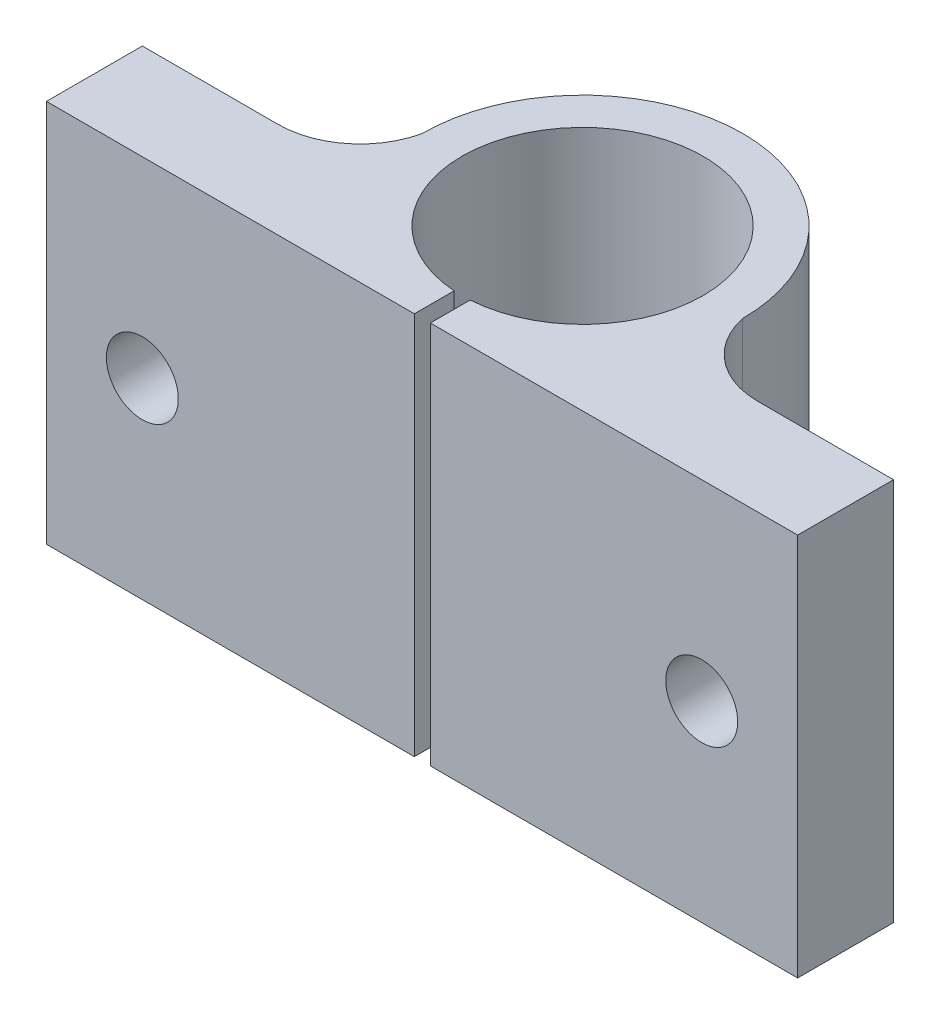
ISO-10303-21;
HEADER;
FILE_DESCRIPTION(('STEP AP214'),'2;1');
FILE_NAME('part.step','',(''),(''),'','','');
FILE_SCHEMA(('AUTOMOTIVE_DESIGN { 1 0 10303 214 1 1 1 1 }'));
ENDSEC;
DATA;
#1=APPLICATION_CONTEXT('core data for automotive mechanical design processes');
#2=APPLICATION_PROTOCOL_DEFINITION('international standard','automotive_design',2000,#1);
#3=PRODUCT_CONTEXT('',#1,'mechanical');
#4=PRODUCT('Part','Part','',(#3));
#5=PRODUCT_RELATED_PRODUCT_CATEGORY('part','',(#4));
#6=PRODUCT_DEFINITION_FORMATION('','',#4);
#7=PRODUCT_DEFINITION_CONTEXT('part definition',#1,'design');
#8=PRODUCT_DEFINITION('design','',#6,#7);
#9=PRODUCT_DEFINITION_SHAPE('','',#8);
#10=(LENGTH_UNIT() NAMED_UNIT(*) SI_UNIT(.MILLI.,.METRE.));
#11=(NAMED_UNIT(*) PLANE_ANGLE_UNIT() SI_UNIT($,.RADIAN.));
#12=(NAMED_UNIT(*) SI_UNIT($,.STERADIAN.) SOLID_ANGLE_UNIT());
#13=UNCERTAINTY_MEASURE_WITH_UNIT(LENGTH_MEASURE(1.E-05),#10,'distance_accuracy_value','');
#14=(GEOMETRIC_REPRESENTATION_CONTEXT(3) GLOBAL_UNCERTAINTY_ASSIGNED_CONTEXT((#13)) GLOBAL_UNIT_ASSIGNED_CONTEXT((#10,
#11,#12)) REPRESENTATION_CONTEXT('',''));
#15=CARTESIAN_POINT('',(0.,0.,0.));
#16=DIRECTION('',(0.,0.,1.));
#17=DIRECTION('',(1.,0.,0.));
#18=AXIS2_PLACEMENT_3D('',#15,#16,#17);
#19=CARTESIAN_POINT('',(0.,0.,0.));
#20=DIRECTION('',(0.,0.,1.));
#21=DIRECTION('',(1.,0.,0.));
#22=AXIS2_PLACEMENT_3D('',#19,#20,#21);
#23=PLANE('',#22);
#24=CARTESIAN_POINT('',(41.,12.,0.));
#25=DIRECTION('',(0.,0.,-1.));
#26=DIRECTION('',(-1.,0.,0.));
#27=AXIS2_PLACEMENT_3D('',#24,#25,#26);
#28=CIRCLE('',#27,2.25);
#29=CARTESIAN_POINT('',(38.75,12.,0.));
#30=VERTEX_POINT('',#29);
#31=EDGE_CURVE('E222',#30,#30,#28,.T.);
#32=ORIENTED_EDGE('',*,*,#31,.T.);
#33=EDGE_LOOP('',(#32));
#34=FACE_BOUND('',#33,.T.);
#35=DIRECTION('',(0.,-1.,0.));
#36=VECTOR('',#35,1.);
#37=CARTESIAN_POINT('',(24.0186333106229,24.,0.));
#38=LINE('',#37,#36);
#39=CARTESIAN_POINT('',(24.0186333106229,24.,0.));
#40=VERTEX_POINT('',#39);
#41=CARTESIAN_POINT('',(24.0186333106229,0.,0.));
#42=VERTEX_POINT('',#41);
#43=EDGE_CURVE('E234',#40,#42,#38,.T.);
#44=ORIENTED_EDGE('',*,*,#43,.T.);
#45=DIRECTION('',(1.,0.,0.));
#46=VECTOR('',#45,1.);
#47=CARTESIAN_POINT('',(0.,0.,0.));
#48=LINE('',#47,#46);
#49=CARTESIAN_POINT('',(47.,0.,0.));
#50=VERTEX_POINT('',#49);
#51=EDGE_CURVE('E247',#42,#50,#48,.T.);
#52=ORIENTED_EDGE('',*,*,#51,.T.);
#53=DIRECTION('',(0.,1.,0.));
#54=VECTOR('',#53,1.);
#55=CARTESIAN_POINT('',(47.,0.,0.));
#56=LINE('',#55,#54);
#57=CARTESIAN_POINT('',(47.,24.,0.));
#58=VERTEX_POINT('',#57);
#59=EDGE_CURVE('E173',#50,#58,#56,.T.);
#60=ORIENTED_EDGE('',*,*,#59,.T.);
#61=DIRECTION('',(1.,0.,0.));
#62=VECTOR('',#61,1.);
#63=CARTESIAN_POINT('',(0.,24.,0.));
#64=LINE('',#63,#62);
#65=EDGE_CURVE('E147',#40,#58,#64,.T.);
#66=ORIENTED_EDGE('',*,*,#65,.F.);
#67=EDGE_LOOP('',(#44,#52,#60,#66));
#68=FACE_BOUND('',#67,.T.);
#69=ADVANCED_FACE('F32',(#34,#68),#23,.T.);
#70=CARTESIAN_POINT('',(0.,0.,-6.));
#71=DIRECTION('',(-1.,0.,0.));
#72=DIRECTION('',(0.,0.,1.));
#73=AXIS2_PLACEMENT_3D('',#70,#71,#72);
#74=PLANE('',#73);
#75=DIRECTION('',(0.,0.,1.));
#76=VECTOR('',#75,1.);
#77=CARTESIAN_POINT('',(0.,24.,-6.));
#78=LINE('',#77,#76);
#79=CARTESIAN_POINT('',(0.,24.,-6.));
#80=VERTEX_POINT('',#79);
#81=CARTESIAN_POINT('',(0.,24.,0.));
#82=VERTEX_POINT('',#81);
#83=EDGE_CURVE('E144',#80,#82,#78,.T.);
#84=ORIENTED_EDGE('',*,*,#83,.F.);
#85=DIRECTION('',(0.,1.,0.));
#86=VECTOR('',#85,1.);
#87=CARTESIAN_POINT('',(0.,0.,-6.));
#88=LINE('',#87,#86);
#89=CARTESIAN_POINT('',(0.,0.,-6.));
#90=VERTEX_POINT('',#89);
#91=EDGE_CURVE('E11',#90,#80,#88,.T.);
#92=ORIENTED_EDGE('',*,*,#91,.F.);
#93=DIRECTION('',(0.,0.,1.));
#94=VECTOR('',#93,1.);
#95=CARTESIAN_POINT('',(0.,0.,-6.));
#96=LINE('',#95,#94);
#97=CARTESIAN_POINT('',(0.,0.,0.));
#98=VERTEX_POINT('',#97);
#99=EDGE_CURVE('E166',#90,#98,#96,.T.);
#100=ORIENTED_EDGE('',*,*,#99,.T.);
#101=DIRECTION('',(0.,1.,0.));
#102=VECTOR('',#101,1.);
#103=CARTESIAN_POINT('',(0.,0.,0.));
#104=LINE('',#103,#102);
#105=EDGE_CURVE('E36',#98,#82,#104,.T.);
#106=ORIENTED_EDGE('',*,*,#105,.T.);
#107=EDGE_LOOP('',(#84,#92,#100,#106));
#108=FACE_BOUND('',#107,.T.);
#109=ADVANCED_FACE('F34',(#108),#74,.T.);
#110=CARTESIAN_POINT('',(8.50000000000001,0.,-6.));
#111=DIRECTION('',(0.,0.,-1.));
#112=DIRECTION('',(-1.,0.,0.));
#113=AXIS2_PLACEMENT_3D('',#110,#111,#112);
#114=PLANE('',#113);
#115=CARTESIAN_POINT('',(5.99999999999998,12.,-6.00000000000001));
#116=DIRECTION('',(0.,0.,-1.));
#117=DIRECTION('',(-1.,0.,0.));
#118=AXIS2_PLACEMENT_3D('',#115,#116,#117);
#119=CIRCLE('',#118,2.25);
#120=CARTESIAN_POINT('',(3.74999999999998,12.,-6.00000000000001));
#121=VERTEX_POINT('',#120);
#122=EDGE_CURVE('E217',#121,#121,#119,.T.);
#123=ORIENTED_EDGE('',*,*,#122,.F.);
#124=EDGE_LOOP('',(#123));
#125=FACE_BOUND('',#124,.T.);
#126=DIRECTION('',(-1.,0.,0.));
#127=VECTOR('',#126,1.);
#128=CARTESIAN_POINT('',(8.50000000000001,24.,-6.));
#129=LINE('',#128,#127);
#130=CARTESIAN_POINT('',(8.50000000000001,24.,-6.00000000000002));
#131=VERTEX_POINT('',#130);
#132=EDGE_CURVE('E164',#131,#80,#129,.T.);
#133=ORIENTED_EDGE('',*,*,#132,.F.);
#134=DIRECTION('',(0.,1.,0.));
#135=VECTOR('',#134,1.);
#136=CARTESIAN_POINT('',(8.50000000000001,0.,-6.00000000000002));
#137=LINE('',#136,#135);
#138=CARTESIAN_POINT('',(8.50000000000001,0.,-6.00000000000002));
#139=VERTEX_POINT('',#138);
#140=EDGE_CURVE('E41',#139,#131,#137,.T.);
#141=ORIENTED_EDGE('',*,*,#140,.F.);
#142=DIRECTION('',(-1.,0.,0.));
#143=VECTOR('',#142,1.);
#144=CARTESIAN_POINT('',(8.50000000000001,0.,-6.));
#145=LINE('',#144,#143);
#146=EDGE_CURVE('E134',#139,#90,#145,.T.);
#147=ORIENTED_EDGE('',*,*,#146,.T.);
#148=ORIENTED_EDGE('',*,*,#91,.T.);
#149=EDGE_LOOP('',(#133,#141,#147,#148));
#150=FACE_BOUND('',#149,.T.);
#151=ADVANCED_FACE('F186',(#125,#150),#114,.T.);
#152=CARTESIAN_POINT('',(8.50000000000001,0.,-11.1210427356607));
#153=DIRECTION('',(0.,1.,0.));
#154=DIRECTION('',(0.,0.,1.));
#155=AXIS2_PLACEMENT_3D('',#152,#153,#154);
#156=CYLINDRICAL_SURFACE('',#155,5.12104273566066);
#157=CARTESIAN_POINT('',(8.50000000000001,24.,-11.1210427356607));
#158=DIRECTION('',(0.,-1.,0.));
#159=DIRECTION('',(0.,0.,-1.));
#160=AXIS2_PLACEMENT_3D('',#157,#158,#159);
#161=CIRCLE('',#160,5.12104273566066);
#162=CARTESIAN_POINT('',(13.4959473897421,24.,-9.99605901160399));
#163=VERTEX_POINT('',#162);
#164=EDGE_CURVE('E120',#163,#131,#161,.T.);
#165=ORIENTED_EDGE('',*,*,#164,.F.);
#166=DIRECTION('',(0.,1.,0.));
#167=VECTOR('',#166,1.);
#168=CARTESIAN_POINT('',(13.4959473897421,0.,-9.99605901160399));
#169=LINE('',#168,#167);
#170=CARTESIAN_POINT('',(13.4959473897421,0.,-9.99605901160399));
#171=VERTEX_POINT('',#170);
#172=EDGE_CURVE('E114',#171,#163,#169,.T.);
#173=ORIENTED_EDGE('',*,*,#172,.F.);
#174=CARTESIAN_POINT('',(8.50000000000001,0.,-11.1210427356607));
#175=DIRECTION('',(0.,-1.,0.));
#176=DIRECTION('',(0.,0.,-1.));
#177=AXIS2_PLACEMENT_3D('',#174,#175,#176);
#178=CIRCLE('',#177,5.12104273566066);
#179=EDGE_CURVE('E117',#171,#139,#178,.T.);
#180=ORIENTED_EDGE('',*,*,#179,.T.);
#181=ORIENTED_EDGE('',*,*,#140,.T.);
#182=EDGE_LOOP('',(#165,#173,#180,#181));
#183=FACE_BOUND('',#182,.T.);
#184=ADVANCED_FACE('F116',(#183),#156,.F.);
#185=CARTESIAN_POINT('',(23.5186333106229,0.,-10.0227213844719));
#186=DIRECTION('',(0.,1.,0.));
#187=DIRECTION('',(0.,0.,1.));
#188=AXIS2_PLACEMENT_3D('',#185,#186,#187);
#189=CYLINDRICAL_SURFACE('',#188,10.0227213844719);
#190=CARTESIAN_POINT('',(23.5186333106229,24.,-10.0227213844719));
#191=DIRECTION('',(0.,1.,0.));
#192=DIRECTION('',(0.,0.,1.));
#193=AXIS2_PLACEMENT_3D('',#190,#191,#192);
#194=CIRCLE('',#193,10.0227213844719);
#195=CARTESIAN_POINT('',(33.5413546555968,24.,-10.021831577252));
#196=VERTEX_POINT('',#195);
#197=EDGE_CURVE('E161',#196,#163,#194,.T.);
#198=ORIENTED_EDGE('',*,*,#197,.F.);
#199=DIRECTION('',(0.,1.,0.));
#200=VECTOR('',#199,1.);
#201=CARTESIAN_POINT('',(33.5413546555968,0.,-10.021831577252));
#202=LINE('',#201,#200);
#203=CARTESIAN_POINT('',(33.5413546555968,0.,-10.021831577252));
#204=VERTEX_POINT('',#203);
#205=EDGE_CURVE('E125',#204,#196,#202,.T.);
#206=ORIENTED_EDGE('',*,*,#205,.F.);
#207=CARTESIAN_POINT('',(23.5186333106229,0.,-10.0227213844719));
#208=DIRECTION('',(0.,1.,0.));
#209=DIRECTION('',(0.,0.,1.));
#210=AXIS2_PLACEMENT_3D('',#207,#208,#209);
#211=CIRCLE('',#210,10.0227213844719);
#212=EDGE_CURVE('E132',#204,#171,#211,.T.);
#213=ORIENTED_EDGE('',*,*,#212,.T.);
#214=ORIENTED_EDGE('',*,*,#172,.T.);
#215=EDGE_LOOP('',(#198,#206,#213,#214));
#216=FACE_BOUND('',#215,.T.);
#217=ADVANCED_FACE('F136',(#216),#189,.T.);
#218=CARTESIAN_POINT('',(38.5000000000001,0.,-11.0677523541657));
#219=DIRECTION('',(0.,1.,0.));
#220=DIRECTION('',(0.,0.,1.));
#221=AXIS2_PLACEMENT_3D('',#218,#219,#220);
#222=CYLINDRICAL_SURFACE('',#221,5.06775235416579);
#223=CARTESIAN_POINT('',(38.5000000000001,24.,-11.0677523541657));
#224=DIRECTION('',(0.,-1.,0.));
#225=DIRECTION('',(0.,0.,-1.));
#226=AXIS2_PLACEMENT_3D('',#223,#224,#225);
#227=CIRCLE('',#226,5.06775235416579);
#228=CARTESIAN_POINT('',(38.5,24.,-6.00000000000001));
#229=VERTEX_POINT('',#228);
#230=EDGE_CURVE('E158',#229,#196,#227,.T.);
#231=ORIENTED_EDGE('',*,*,#230,.F.);
#232=DIRECTION('',(0.,1.,0.));
#233=VECTOR('',#232,1.);
#234=CARTESIAN_POINT('',(38.5,0.,-6.00000000000001));
#235=LINE('',#234,#233);
#236=CARTESIAN_POINT('',(38.5,0.,-6.00000000000001));
#237=VERTEX_POINT('',#236);
#238=EDGE_CURVE('E170',#237,#229,#235,.T.);
#239=ORIENTED_EDGE('',*,*,#238,.F.);
#240=CARTESIAN_POINT('',(38.5000000000001,0.,-11.0677523541657));
#241=DIRECTION('',(0.,-1.,0.));
#242=DIRECTION('',(0.,0.,-1.));
#243=AXIS2_PLACEMENT_3D('',#240,#241,#242);
#244=CIRCLE('',#243,5.06775235416579);
#245=EDGE_CURVE('E137',#237,#204,#244,.T.);
#246=ORIENTED_EDGE('',*,*,#245,.T.);
#247=ORIENTED_EDGE('',*,*,#205,.T.);
#248=EDGE_LOOP('',(#231,#239,#246,#247));
#249=FACE_BOUND('',#248,.T.);
#250=ADVANCED_FACE('F305',(#249),#222,.F.);
#251=CARTESIAN_POINT('',(47.,0.,-6.));
#252=DIRECTION('',(0.,0.,-1.));
#253=DIRECTION('',(-1.,0.,0.));
#254=AXIS2_PLACEMENT_3D('',#251,#252,#253);
#255=PLANE('',#254);
#256=CARTESIAN_POINT('',(41.,12.,-6.00000000000001));
#257=DIRECTION('',(0.,0.,-1.));
#258=DIRECTION('',(-1.,0.,0.));
#259=AXIS2_PLACEMENT_3D('',#256,#257,#258);
#260=CIRCLE('',#259,2.25);
#261=CARTESIAN_POINT('',(38.75,12.,-6.00000000000001));
#262=VERTEX_POINT('',#261);
#263=EDGE_CURVE('E301',#262,#262,#260,.T.);
#264=ORIENTED_EDGE('',*,*,#263,.F.);
#265=EDGE_LOOP('',(#264));
#266=FACE_BOUND('',#265,.T.);
#267=DIRECTION('',(-1.,0.,0.));
#268=VECTOR('',#267,1.);
#269=CARTESIAN_POINT('',(47.,24.,-6.));
#270=LINE('',#269,#268);
#271=CARTESIAN_POINT('',(47.,24.,-6.));
#272=VERTEX_POINT('',#271);
#273=EDGE_CURVE('E155',#272,#229,#270,.T.);
#274=ORIENTED_EDGE('',*,*,#273,.F.);
#275=DIRECTION('',(0.,1.,0.));
#276=VECTOR('',#275,1.);
#277=CARTESIAN_POINT('',(47.,0.,-6.));
#278=LINE('',#277,#276);
#279=CARTESIAN_POINT('',(47.,0.,-6.));
#280=VERTEX_POINT('',#279);
#281=EDGE_CURVE('E172',#280,#272,#278,.T.);
#282=ORIENTED_EDGE('',*,*,#281,.F.);
#283=DIRECTION('',(-1.,0.,0.));
#284=VECTOR('',#283,1.);
#285=CARTESIAN_POINT('',(47.,0.,-6.));
#286=LINE('',#285,#284);
#287=EDGE_CURVE('E139',#280,#237,#286,.T.);
#288=ORIENTED_EDGE('',*,*,#287,.T.);
#289=ORIENTED_EDGE('',*,*,#238,.T.);
#290=EDGE_LOOP('',(#274,#282,#288,#289));
#291=FACE_BOUND('',#290,.T.);
#292=ADVANCED_FACE('F211',(#266,#291),#255,.T.);
#293=CARTESIAN_POINT('',(47.,0.,0.));
#294=DIRECTION('',(1.,0.,0.));
#295=DIRECTION('',(0.,0.,-1.));
#296=AXIS2_PLACEMENT_3D('',#293,#294,#295);
#297=PLANE('',#296);
#298=DIRECTION('',(0.,0.,-1.));
#299=VECTOR('',#298,1.);
#300=CARTESIAN_POINT('',(47.,24.,0.));
#301=LINE('',#300,#299);
#302=EDGE_CURVE('E152',#58,#272,#301,.T.);
#303=ORIENTED_EDGE('',*,*,#302,.F.);
#304=ORIENTED_EDGE('',*,*,#59,.F.);
#305=DIRECTION('',(0.,0.,-1.));
#306=VECTOR('',#305,1.);
#307=CARTESIAN_POINT('',(47.,0.,0.));
#308=LINE('',#307,#306);
#309=EDGE_CURVE('E250',#50,#280,#308,.T.);
#310=ORIENTED_EDGE('',*,*,#309,.T.);
#311=ORIENTED_EDGE('',*,*,#281,.T.);
#312=EDGE_LOOP('',(#303,#304,#310,#311));
#313=FACE_BOUND('',#312,.T.);
#314=ADVANCED_FACE('F204',(#313),#297,.T.);
#315=CARTESIAN_POINT('',(5.99999999999998,12.,0.));
#316=DIRECTION('',(0.,0.,-1.));
#317=DIRECTION('',(-1.,0.,0.));
#318=AXIS2_PLACEMENT_3D('',#315,#316,#317);
#319=CIRCLE('',#318,2.25);
#320=CARTESIAN_POINT('',(3.74999999999998,12.,0.));
#321=VERTEX_POINT('',#320);
#322=EDGE_CURVE('E215',#321,#321,#319,.T.);
#323=ORIENTED_EDGE('',*,*,#322,.T.);
#324=EDGE_LOOP('',(#323));
#325=FACE_BOUND('',#324,.T.);
#326=DIRECTION('',(0.,-1.,0.));
#327=VECTOR('',#326,1.);
#328=CARTESIAN_POINT('',(23.0186333106229,24.,0.));
#329=LINE('',#328,#327);
#330=CARTESIAN_POINT('',(23.0186333106229,24.,0.));
#331=VERTEX_POINT('',#330);
#332=CARTESIAN_POINT('',(23.0186333106229,0.,0.));
#333=VERTEX_POINT('',#332);
#334=EDGE_CURVE('E182',#331,#333,#329,.T.);
#335=ORIENTED_EDGE('',*,*,#334,.F.);
#336=EDGE_CURVE('E149',#82,#331,#64,.T.);
#337=ORIENTED_EDGE('',*,*,#336,.F.);
#338=ORIENTED_EDGE('',*,*,#105,.F.);
#339=EDGE_CURVE('E248',#98,#333,#48,.T.);
#340=ORIENTED_EDGE('',*,*,#339,.T.);
#341=EDGE_LOOP('',(#335,#337,#338,#340));
#342=FACE_BOUND('',#341,.T.);
#343=ADVANCED_FACE('F180',(#325,#342),#23,.T.);
#344=CARTESIAN_POINT('',(38.5000000000001,0.,-11.0677523541657));
#345=DIRECTION('',(0.,-1.,0.));
#346=DIRECTION('',(0.,0.,-1.));
#347=AXIS2_PLACEMENT_3D('',#344,#345,#346);
#348=PLANE('',#347);
#349=CARTESIAN_POINT('',(23.5186333106229,0.,-10.022721384472));
#350=DIRECTION('',(0.,1.,0.));
#351=DIRECTION('',(0.,0.,1.));
#352=AXIS2_PLACEMENT_3D('',#349,#350,#351);
#353=CIRCLE('',#352,7.55000000000005);
#354=CARTESIAN_POINT('',(24.0186333106229,0.,-2.48929586881175));
#355=VERTEX_POINT('',#354);
#356=CARTESIAN_POINT('',(23.0186333106229,0.,-2.48929586881175));
#357=VERTEX_POINT('',#356);
#358=EDGE_CURVE('E219',#355,#357,#353,.T.);
#359=ORIENTED_EDGE('',*,*,#358,.T.);
#360=DIRECTION('',(0.,0.,-1.));
#361=VECTOR('',#360,1.);
#362=CARTESIAN_POINT('',(23.0186333106229,0.,0.));
#363=LINE('',#362,#361);
#364=EDGE_CURVE('E232',#333,#357,#363,.T.);
#365=ORIENTED_EDGE('',*,*,#364,.F.);
#366=ORIENTED_EDGE('',*,*,#339,.F.);
#367=ORIENTED_EDGE('',*,*,#99,.F.);
#368=ORIENTED_EDGE('',*,*,#146,.F.);
#369=ORIENTED_EDGE('',*,*,#179,.F.);
#370=ORIENTED_EDGE('',*,*,#212,.F.);
#371=ORIENTED_EDGE('',*,*,#245,.F.);
#372=ORIENTED_EDGE('',*,*,#287,.F.);
#373=ORIENTED_EDGE('',*,*,#309,.F.);
#374=ORIENTED_EDGE('',*,*,#51,.F.);
#375=DIRECTION('',(0.,0.,1.));
#376=VECTOR('',#375,1.);
#377=CARTESIAN_POINT('',(24.0186333106229,0.,-2.48929586881175));
#378=LINE('',#377,#376);
#379=EDGE_CURVE('E227',#355,#42,#378,.T.);
#380=ORIENTED_EDGE('',*,*,#379,.F.);
#381=EDGE_LOOP('',(#359,#365,#366,#367,#368,#369,#370,#371,#372,#373,#374,#380));
#382=FACE_BOUND('',#381,.T.);
#383=ADVANCED_FACE('F130',(#382),#348,.T.);
#384=CARTESIAN_POINT('',(38.5000000000001,24.,-11.0677523541657));
#385=DIRECTION('',(0.,-1.,0.));
#386=DIRECTION('',(0.,0.,-1.));
#387=AXIS2_PLACEMENT_3D('',#384,#385,#386);
#388=PLANE('',#387);
#389=DIRECTION('',(0.,0.,-1.));
#390=VECTOR('',#389,1.);
#391=CARTESIAN_POINT('',(23.0186333106229,24.,0.));
#392=LINE('',#391,#390);
#393=CARTESIAN_POINT('',(23.0186333106229,24.,-2.48929586881175));
#394=VERTEX_POINT('',#393);
#395=EDGE_CURVE('E231',#331,#394,#392,.T.);
#396=ORIENTED_EDGE('',*,*,#395,.T.);
#397=CARTESIAN_POINT('',(23.5186333106229,24.,-10.022721384472));
#398=DIRECTION('',(0.,1.,0.));
#399=DIRECTION('',(0.,0.,1.));
#400=AXIS2_PLACEMENT_3D('',#397,#398,#399);
#401=CIRCLE('',#400,7.55000000000005);
#402=CARTESIAN_POINT('',(24.0186333106229,24.,-2.48929586881175));
#403=VERTEX_POINT('',#402);
#404=EDGE_CURVE('E49',#403,#394,#401,.T.);
#405=ORIENTED_EDGE('',*,*,#404,.F.);
#406=DIRECTION('',(0.,0.,1.));
#407=VECTOR('',#406,1.);
#408=CARTESIAN_POINT('',(24.0186333106229,24.,-2.48929586881175));
#409=LINE('',#408,#407);
#410=EDGE_CURVE('E228',#403,#40,#409,.T.);
#411=ORIENTED_EDGE('',*,*,#410,.T.);
#412=ORIENTED_EDGE('',*,*,#65,.T.);
#413=ORIENTED_EDGE('',*,*,#302,.T.);
#414=ORIENTED_EDGE('',*,*,#273,.T.);
#415=ORIENTED_EDGE('',*,*,#230,.T.);
#416=ORIENTED_EDGE('',*,*,#197,.T.);
#417=ORIENTED_EDGE('',*,*,#164,.T.);
#418=ORIENTED_EDGE('',*,*,#132,.T.);
#419=ORIENTED_EDGE('',*,*,#83,.T.);
#420=ORIENTED_EDGE('',*,*,#336,.T.);
#421=EDGE_LOOP('',(#396,#405,#411,#412,#413,#414,#415,#416,#417,#418,#419,#420));
#422=FACE_BOUND('',#421,.T.);
#423=ADVANCED_FACE('F185',(#422),#388,.F.);
#424=CARTESIAN_POINT('',(24.0186333106229,24.,-2.48929586881175));
#425=DIRECTION('',(1.,0.,0.));
#426=DIRECTION('',(0.,0.,-1.));
#427=AXIS2_PLACEMENT_3D('',#424,#425,#426);
#428=PLANE('',#427);
#429=ORIENTED_EDGE('',*,*,#379,.T.);
#430=ORIENTED_EDGE('',*,*,#43,.F.);
#431=ORIENTED_EDGE('',*,*,#410,.F.);
#432=DIRECTION('',(0.,-1.,0.));
#433=VECTOR('',#432,1.);
#434=CARTESIAN_POINT('',(24.0186333106229,24.,-2.48929586881175));
#435=LINE('',#434,#433);
#436=EDGE_CURVE('E148',#403,#355,#435,.T.);
#437=ORIENTED_EDGE('',*,*,#436,.T.);
#438=EDGE_LOOP('',(#429,#430,#431,#437));
#439=FACE_BOUND('',#438,.T.);
#440=ADVANCED_FACE('F276',(#439),#428,.F.);
#441=CARTESIAN_POINT('',(23.0186333106229,24.,0.));
#442=DIRECTION('',(-1.,0.,0.));
#443=DIRECTION('',(0.,0.,1.));
#444=AXIS2_PLACEMENT_3D('',#441,#442,#443);
#445=PLANE('',#444);
#446=ORIENTED_EDGE('',*,*,#364,.T.);
#447=DIRECTION('',(0.,-1.,0.));
#448=VECTOR('',#447,1.);
#449=CARTESIAN_POINT('',(23.0186333106229,24.,-2.48929586881175));
#450=LINE('',#449,#448);
#451=EDGE_CURVE('E241',#394,#357,#450,.T.);
#452=ORIENTED_EDGE('',*,*,#451,.F.);
#453=ORIENTED_EDGE('',*,*,#395,.F.);
#454=ORIENTED_EDGE('',*,*,#334,.T.);
#455=EDGE_LOOP('',(#446,#452,#453,#454));
#456=FACE_BOUND('',#455,.T.);
#457=ADVANCED_FACE('F278',(#456),#445,.F.);
#458=CARTESIAN_POINT('',(23.5186333106229,0.,-10.022721384472));
#459=DIRECTION('',(0.,1.,0.));
#460=DIRECTION('',(0.,0.,1.));
#461=AXIS2_PLACEMENT_3D('',#458,#459,#460);
#462=CYLINDRICAL_SURFACE('',#461,7.55000000000005);
#463=ORIENTED_EDGE('',*,*,#404,.T.);
#464=ORIENTED_EDGE('',*,*,#451,.T.);
#465=ORIENTED_EDGE('',*,*,#358,.F.);
#466=ORIENTED_EDGE('',*,*,#436,.F.);
#467=EDGE_LOOP('',(#463,#464,#465,#466));
#468=FACE_BOUND('',#467,.T.);
#469=ADVANCED_FACE('F275',(#468),#462,.F.);
#470=CARTESIAN_POINT('',(5.99999999999998,12.,-6.00000000000001));
#471=DIRECTION('',(0.,0.,-1.));
#472=DIRECTION('',(-1.,0.,0.));
#473=AXIS2_PLACEMENT_3D('',#470,#471,#472);
#474=CYLINDRICAL_SURFACE('',#473,2.25);
#475=ORIENTED_EDGE('',*,*,#322,.F.);
#476=EDGE_LOOP('',(#475));
#477=FACE_BOUND('',#476,.T.);
#478=ORIENTED_EDGE('',*,*,#122,.T.);
#479=EDGE_LOOP('',(#478));
#480=FACE_BOUND('',#479,.T.);
#481=ADVANCED_FACE('F289',(#477,#480),#474,.F.);
#482=CARTESIAN_POINT('',(41.,12.,-6.00000000000001));
#483=DIRECTION('',(0.,0.,-1.));
#484=DIRECTION('',(-1.,0.,0.));
#485=AXIS2_PLACEMENT_3D('',#482,#483,#484);
#486=CYLINDRICAL_SURFACE('',#485,2.25);
#487=ORIENTED_EDGE('',*,*,#31,.F.);
#488=EDGE_LOOP('',(#487));
#489=FACE_BOUND('',#488,.T.);
#490=ORIENTED_EDGE('',*,*,#263,.T.);
#491=EDGE_LOOP('',(#490));
#492=FACE_BOUND('',#491,.T.);
#493=ADVANCED_FACE('F292',(#489,#492),#486,.F.);
#494=CLOSED_SHELL('',(#69,#109,#151,#184,#217,#250,#292,#314,#343,#383,#423,#440,#457,#469,#481,#493));
#495=MANIFOLD_SOLID_BREP('B2',#494);
#496=ADVANCED_BREP_SHAPE_REPRESENTATION('',(#18,#495),#14);
#497=SHAPE_DEFINITION_REPRESENTATION(#9,#496);
ENDSEC;
END-ISO-10303-21;
